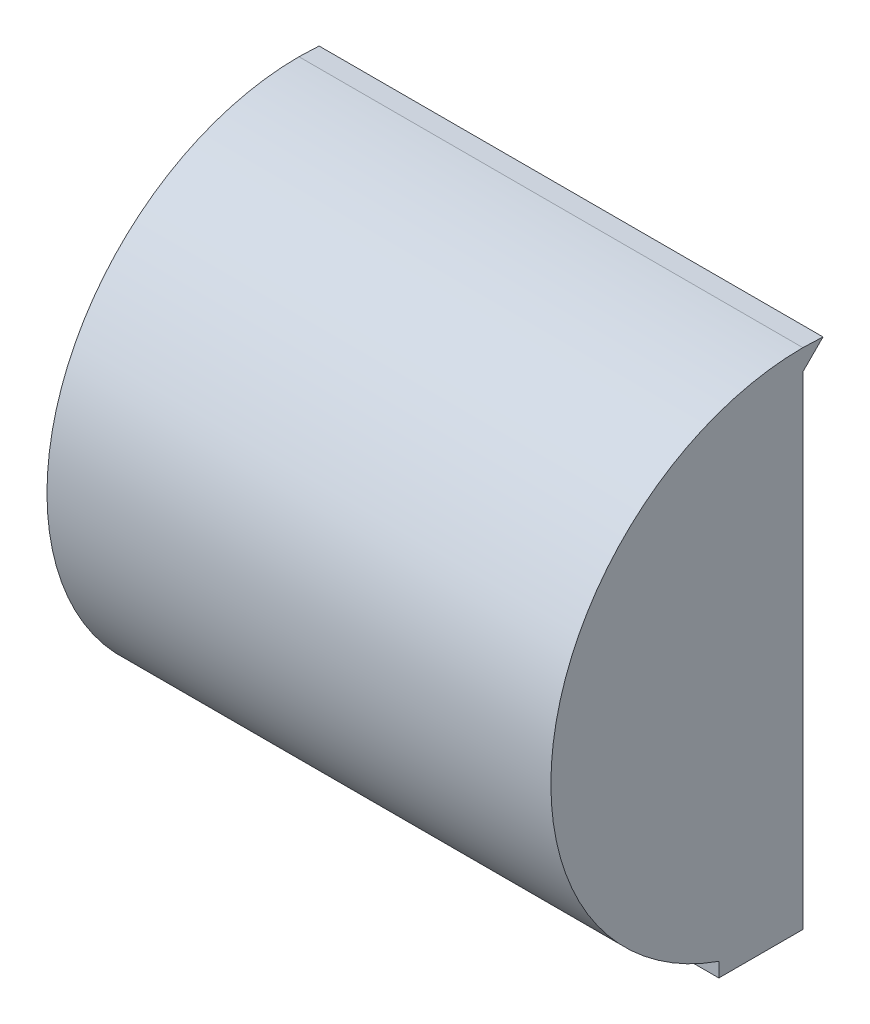
ISO-10303-21;
HEADER;
FILE_DESCRIPTION(('STEP AP214'),'2;1');
FILE_NAME('part.step','',(''),(''),'','','');
FILE_SCHEMA(('AUTOMOTIVE_DESIGN { 1 0 10303 214 1 1 1 1 }'));
ENDSEC;
DATA;
#1=APPLICATION_CONTEXT('core data for automotive mechanical design processes');
#2=APPLICATION_PROTOCOL_DEFINITION('international standard','automotive_design',2000,#1);
#3=PRODUCT_CONTEXT('',#1,'mechanical');
#4=PRODUCT('Part','Part','',(#3));
#5=PRODUCT_RELATED_PRODUCT_CATEGORY('part','',(#4));
#6=PRODUCT_DEFINITION_FORMATION('','',#4);
#7=PRODUCT_DEFINITION_CONTEXT('part definition',#1,'design');
#8=PRODUCT_DEFINITION('design','',#6,#7);
#9=PRODUCT_DEFINITION_SHAPE('','',#8);
#10=(LENGTH_UNIT() NAMED_UNIT(*) SI_UNIT(.MILLI.,.METRE.));
#11=(NAMED_UNIT(*) PLANE_ANGLE_UNIT() SI_UNIT($,.RADIAN.));
#12=(NAMED_UNIT(*) SI_UNIT($,.STERADIAN.) SOLID_ANGLE_UNIT());
#13=UNCERTAINTY_MEASURE_WITH_UNIT(LENGTH_MEASURE(1.E-05),#10,'distance_accuracy_value','');
#14=(GEOMETRIC_REPRESENTATION_CONTEXT(3) GLOBAL_UNCERTAINTY_ASSIGNED_CONTEXT((#13)) GLOBAL_UNIT_ASSIGNED_CONTEXT((#10,
#11,#12)) REPRESENTATION_CONTEXT('',''));
#15=CARTESIAN_POINT('',(0.,0.,0.));
#16=DIRECTION('',(0.,0.,1.));
#17=DIRECTION('',(1.,0.,0.));
#18=AXIS2_PLACEMENT_3D('',#15,#16,#17);
#19=CARTESIAN_POINT('',(38.1,38.1,0.));
#20=DIRECTION('',(-1.,0.,0.));
#21=DIRECTION('',(0.,0.,1.));
#22=AXIS2_PLACEMENT_3D('',#19,#20,#21);
#23=CYLINDRICAL_SURFACE('',#22,38.1);
#24=DIRECTION('',(-1.,0.,0.));
#25=VECTOR('',#24,1.);
#26=CARTESIAN_POINT('',(38.1,2.17897551572341,12.7));
#27=LINE('',#26,#25);
#28=CARTESIAN_POINT('',(38.1,2.1789755157234,12.7));
#29=VERTEX_POINT('',#28);
#30=CARTESIAN_POINT('',(-38.1,2.1789755157234,12.7));
#31=VERTEX_POINT('',#30);
#32=EDGE_CURVE('E142',#29,#31,#27,.T.);
#33=ORIENTED_EDGE('',*,*,#32,.F.);
#34=CARTESIAN_POINT('',(38.1,38.1,0.));
#35=DIRECTION('',(1.,0.,0.));
#36=DIRECTION('',(0.,0.,-1.));
#37=AXIS2_PLACEMENT_3D('',#34,#35,#36);
#38=CIRCLE('',#37,38.1);
#39=CARTESIAN_POINT('',(38.1,76.2,0.));
#40=VERTEX_POINT('',#39);
#41=EDGE_CURVE('E161',#40,#29,#38,.T.);
#42=ORIENTED_EDGE('',*,*,#41,.F.);
#43=DIRECTION('',(-1.,0.,0.));
#44=VECTOR('',#43,1.);
#45=CARTESIAN_POINT('',(38.1,76.2,0.));
#46=LINE('',#45,#44);
#47=CARTESIAN_POINT('',(-38.1,76.2,0.));
#48=VERTEX_POINT('',#47);
#49=EDGE_CURVE('E44',#40,#48,#46,.T.);
#50=ORIENTED_EDGE('',*,*,#49,.T.);
#51=CARTESIAN_POINT('',(-38.1,38.1,0.));
#52=DIRECTION('',(1.,0.,0.));
#53=DIRECTION('',(0.,0.,-1.));
#54=AXIS2_PLACEMENT_3D('',#51,#52,#53);
#55=CIRCLE('',#54,38.1);
#56=EDGE_CURVE('E154',#48,#31,#55,.T.);
#57=ORIENTED_EDGE('',*,*,#56,.T.);
#58=EDGE_LOOP('',(#33,#42,#50,#57));
#59=FACE_BOUND('',#58,.T.);
#60=ADVANCED_FACE('F36',(#59),#23,.T.);
#61=CARTESIAN_POINT('',(38.1,76.2,0.));
#62=DIRECTION('',(0.,0.,1.));
#63=DIRECTION('',(1.,0.,0.));
#64=AXIS2_PLACEMENT_3D('',#61,#62,#63);
#65=PLANE('',#64);
#66=DIRECTION('',(0.,1.,0.));
#67=VECTOR('',#66,1.);
#68=CARTESIAN_POINT('',(-38.1,76.2,0.));
#69=LINE('',#68,#67);
#70=CARTESIAN_POINT('',(-38.1,0.,0.));
#71=VERTEX_POINT('',#70);
#72=CARTESIAN_POINT('',(-38.1,73.025,0.));
#73=VERTEX_POINT('',#72);
#74=EDGE_CURVE('E58',#71,#73,#69,.T.);
#75=ORIENTED_EDGE('',*,*,#74,.T.);
#76=DIRECTION('',(1.,0.,0.));
#77=VECTOR('',#76,1.);
#78=CARTESIAN_POINT('',(-42.5043740207652,73.025,0.));
#79=LINE('',#78,#77);
#80=CARTESIAN_POINT('',(-34.925,73.025,0.));
#81=VERTEX_POINT('',#80);
#82=EDGE_CURVE('E114',#73,#81,#79,.T.);
#83=ORIENTED_EDGE('',*,*,#82,.T.);
#84=DIRECTION('',(0.,1.,0.));
#85=VECTOR('',#84,1.);
#86=CARTESIAN_POINT('',(-34.925,76.2,0.));
#87=LINE('',#86,#85);
#88=CARTESIAN_POINT('',(-34.925,3.17500000000001,0.));
#89=VERTEX_POINT('',#88);
#90=EDGE_CURVE('E148',#89,#81,#87,.T.);
#91=ORIENTED_EDGE('',*,*,#90,.F.);
#92=DIRECTION('',(-1.,0.,0.));
#93=VECTOR('',#92,1.);
#94=CARTESIAN_POINT('',(34.925,3.17500000000001,0.));
#95=LINE('',#94,#93);
#96=CARTESIAN_POINT('',(34.925,3.17500000000001,0.));
#97=VERTEX_POINT('',#96);
#98=EDGE_CURVE('E152',#97,#89,#95,.T.);
#99=ORIENTED_EDGE('',*,*,#98,.F.);
#100=DIRECTION('',(0.,1.,0.));
#101=VECTOR('',#100,1.);
#102=CARTESIAN_POINT('',(34.925,76.2,0.));
#103=LINE('',#102,#101);
#104=CARTESIAN_POINT('',(34.925,73.025,0.));
#105=VERTEX_POINT('',#104);
#106=EDGE_CURVE('E151',#97,#105,#103,.T.);
#107=ORIENTED_EDGE('',*,*,#106,.T.);
#108=CARTESIAN_POINT('',(38.1,73.025,0.));
#109=VERTEX_POINT('',#108);
#110=EDGE_CURVE('E52',#105,#109,#79,.T.);
#111=ORIENTED_EDGE('',*,*,#110,.T.);
#112=DIRECTION('',(0.,1.,0.));
#113=VECTOR('',#112,1.);
#114=CARTESIAN_POINT('',(38.1,0.,0.));
#115=LINE('',#114,#113);
#116=CARTESIAN_POINT('',(38.1,0.,0.));
#117=VERTEX_POINT('',#116);
#118=EDGE_CURVE('E125',#117,#109,#115,.T.);
#119=ORIENTED_EDGE('',*,*,#118,.F.);
#120=DIRECTION('',(-1.,0.,0.));
#121=VECTOR('',#120,1.);
#122=CARTESIAN_POINT('',(38.1,0.,0.));
#123=LINE('',#122,#121);
#124=EDGE_CURVE('E11',#117,#71,#123,.T.);
#125=ORIENTED_EDGE('',*,*,#124,.T.);
#126=EDGE_LOOP('',(#75,#83,#91,#99,#107,#111,#119,#125));
#127=FACE_BOUND('',#126,.T.);
#128=ADVANCED_FACE('F210',(#127),#65,.F.);
#129=CARTESIAN_POINT('',(38.1,38.1,0.));
#130=DIRECTION('',(1.,0.,0.));
#131=DIRECTION('',(0.,0.,-1.));
#132=AXIS2_PLACEMENT_3D('',#129,#130,#131);
#133=PLANE('',#132);
#134=ORIENTED_EDGE('',*,*,#118,.T.);
#135=DIRECTION('',(0.,0.707106781186553,-0.707106781186542));
#136=VECTOR('',#135,1.);
#137=CARTESIAN_POINT('',(38.1,76.0775211735206,-3.0525211735206));
#138=LINE('',#137,#136);
#139=CARTESIAN_POINT('',(38.1,76.0775211735206,-3.0525211735206));
#140=VERTEX_POINT('',#139);
#141=EDGE_CURVE('E109',#109,#140,#138,.T.);
#142=ORIENTED_EDGE('',*,*,#141,.T.);
#143=DIRECTION('',(0.,0.0400915662057655,0.999196009959592));
#144=VECTOR('',#143,1.);
#145=CARTESIAN_POINT('',(38.1,76.2,0.));
#146=LINE('',#145,#144);
#147=EDGE_CURVE('E118',#140,#40,#146,.T.);
#148=ORIENTED_EDGE('',*,*,#147,.T.);
#149=ORIENTED_EDGE('',*,*,#41,.T.);
#150=DIRECTION('',(0.,-1.,0.));
#151=VECTOR('',#150,1.);
#152=CARTESIAN_POINT('',(38.1,0.,12.7));
#153=LINE('',#152,#151);
#154=CARTESIAN_POINT('',(38.1,0.,12.7));
#155=VERTEX_POINT('',#154);
#156=EDGE_CURVE('E133',#29,#155,#153,.T.);
#157=ORIENTED_EDGE('',*,*,#156,.T.);
#158=DIRECTION('',(0.,0.,-1.));
#159=VECTOR('',#158,1.);
#160=CARTESIAN_POINT('',(38.1,0.,12.7));
#161=LINE('',#160,#159);
#162=EDGE_CURVE('E139',#155,#117,#161,.T.);
#163=ORIENTED_EDGE('',*,*,#162,.T.);
#164=EDGE_LOOP('',(#134,#142,#148,#149,#157,#163));
#165=FACE_BOUND('',#164,.T.);
#166=ADVANCED_FACE('F124',(#165),#133,.T.);
#167=CARTESIAN_POINT('',(-38.1,38.1,0.));
#168=DIRECTION('',(1.,0.,0.));
#169=DIRECTION('',(0.,0.,-1.));
#170=AXIS2_PLACEMENT_3D('',#167,#168,#169);
#171=PLANE('',#170);
#172=ORIENTED_EDGE('',*,*,#56,.F.);
#173=DIRECTION('',(0.,-0.0400915662057655,-0.999196009959592));
#174=VECTOR('',#173,1.);
#175=CARTESIAN_POINT('',(-38.1,76.2,0.));
#176=LINE('',#175,#174);
#177=CARTESIAN_POINT('',(-38.1,76.0775211735206,-3.0525211735206));
#178=VERTEX_POINT('',#177);
#179=EDGE_CURVE('E134',#48,#178,#176,.T.);
#180=ORIENTED_EDGE('',*,*,#179,.T.);
#181=DIRECTION('',(0.,-0.707106781186553,0.707106781186542));
#182=VECTOR('',#181,1.);
#183=CARTESIAN_POINT('',(-38.1,76.0775211735206,-3.0525211735206));
#184=LINE('',#183,#182);
#185=EDGE_CURVE('E111',#178,#73,#184,.T.);
#186=ORIENTED_EDGE('',*,*,#185,.T.);
#187=ORIENTED_EDGE('',*,*,#74,.F.);
#188=DIRECTION('',(0.,0.,-1.));
#189=VECTOR('',#188,1.);
#190=CARTESIAN_POINT('',(-38.1,0.,12.7));
#191=LINE('',#190,#189);
#192=CARTESIAN_POINT('',(-38.1,0.,12.7));
#193=VERTEX_POINT('',#192);
#194=EDGE_CURVE('E140',#193,#71,#191,.T.);
#195=ORIENTED_EDGE('',*,*,#194,.F.);
#196=DIRECTION('',(0.,1.,0.));
#197=VECTOR('',#196,1.);
#198=CARTESIAN_POINT('',(-38.1,0.,12.7));
#199=LINE('',#198,#197);
#200=EDGE_CURVE('E130',#193,#31,#199,.T.);
#201=ORIENTED_EDGE('',*,*,#200,.T.);
#202=EDGE_LOOP('',(#172,#180,#186,#187,#195,#201));
#203=FACE_BOUND('',#202,.T.);
#204=ADVANCED_FACE('F226',(#203),#171,.F.);
#205=CARTESIAN_POINT('',(38.1,38.1,0.));
#206=DIRECTION('',(-1.,0.,0.));
#207=DIRECTION('',(0.,0.,1.));
#208=AXIS2_PLACEMENT_3D('',#205,#206,#207);
#209=CYLINDRICAL_SURFACE('',#208,34.925);
#210=CARTESIAN_POINT('',(19.05,3.29736527215218,2.921));
#211=CARTESIAN_POINT('',(19.2419435148805,3.29736457951155,2.92100822635639));
#212=CARTESIAN_POINT('',(19.4340143083735,3.2987107306847,2.9371701448473));
#213=CARTESIAN_POINT('',(19.8128528578552,3.30419292414882,3.00140546162799));
#214=CARTESIAN_POINT('',(19.9996145287077,3.30833204312787,3.04951405092322));
#215=CARTESIAN_POINT('',(20.3623115529667,3.3196730123046,3.17624047783401));
#216=CARTESIAN_POINT('',(20.5382515627573,3.32687353452728,3.25484508559966));
#217=CARTESIAN_POINT('',(20.8743382027945,3.34472769715652,3.4402475008922));
#218=CARTESIAN_POINT('',(21.0344885484951,3.35538052266277,3.54703865401198));
#219=CARTESIAN_POINT('',(21.3345479523628,3.38057525502671,3.78570027963589));
#220=CARTESIAN_POINT('',(21.4744542367335,3.3951176940545,3.91757418320422));
#221=CARTESIAN_POINT('',(21.7301015455419,3.4284683502658,4.20250504610802));
#222=CARTESIAN_POINT('',(21.8458418393011,3.44727669639664,4.35556264571724));
#223=CARTESIAN_POINT('',(22.0502556589836,3.48942800934829,4.67872896632293));
#224=CARTESIAN_POINT('',(22.1388659625503,3.51278136375459,4.84887630635715));
#225=CARTESIAN_POINT('',(22.2863827921101,3.56397085759978,5.20095536084557));
#226=CARTESIAN_POINT('',(22.3452883524339,3.59180714273513,5.38288745819262));
#227=CARTESIAN_POINT('',(22.4324325610132,3.65190184546445,5.75499529825202));
#228=CARTESIAN_POINT('',(22.4603932372089,3.68419746100796,5.945230057033));
#229=CARTESIAN_POINT('',(22.4842566072378,3.75234347485465,6.32706384168286));
#230=CARTESIAN_POINT('',(22.4801563934269,3.78819419528384,6.51866298971565));
#231=CARTESIAN_POINT('',(22.4399599228012,3.86306349527274,6.90118939783763));
#232=CARTESIAN_POINT('',(22.4033325184463,3.90212485317722,7.09205245494625));
#233=CARTESIAN_POINT('',(22.2985475908971,3.98151604195826,7.46464973562233));
#234=CARTESIAN_POINT('',(22.2303863776877,4.02184602077107,7.64638288806916));
#235=CARTESIAN_POINT('',(22.0631259509903,4.10276298304281,7.99854117440237));
#236=CARTESIAN_POINT('',(21.9635680154462,4.14334441281518,8.16874997765203));
#237=CARTESIAN_POINT('',(21.7364853934103,4.22223129042445,8.48998287743717));
#238=CARTESIAN_POINT('',(21.6089597845096,4.26053666314116,8.64100634095666));
#239=CARTESIAN_POINT('',(21.3296244666985,4.33275885526112,8.91906225379602));
#240=CARTESIAN_POINT('',(21.1778807431087,4.36668715885091,9.04615790317447));
#241=CARTESIAN_POINT('',(20.8539311970648,4.42828927183319,9.27282944986045));
#242=CARTESIAN_POINT('',(20.6817288574404,4.45596414347493,9.37241002170211));
#243=CARTESIAN_POINT('',(20.3268270198199,4.50261384925137,9.53826606838298));
#244=CARTESIAN_POINT('',(20.1445562996869,4.52181053436125,9.60539580933128));
#245=CARTESIAN_POINT('',(19.7706374238165,4.55133518216681,9.70801751192221));
#246=CARTESIAN_POINT('',(19.5789915963566,4.56166533513677,9.74351728710803));
#247=CARTESIAN_POINT('',(19.1989684396047,4.57254686727753,9.78089327589701));
#248=CARTESIAN_POINT('',(19.0107111930407,4.57342759372503,9.78390194882592));
#249=CARTESIAN_POINT('',(18.6364219199386,4.5662083091393,9.75912922046636));
#250=CARTESIAN_POINT('',(18.4503896987602,4.55810908954703,9.73135053259944));
#251=CARTESIAN_POINT('',(18.0880453904976,4.53360959065754,9.6464996913602));
#252=CARTESIAN_POINT('',(17.9116448349354,4.51730787333718,9.58977524104897));
#253=CARTESIAN_POINT('',(17.5709481983597,4.47745636912292,9.44910042995448));
#254=CARTESIAN_POINT('',(17.4066532226497,4.45390592139539,9.36514758684553));
#255=CARTESIAN_POINT('',(17.090974844024,4.40033491367606,9.17052681188093));
#256=CARTESIAN_POINT('',(16.9399399200943,4.37018752067315,9.0593291890433));
#257=CARTESIAN_POINT('',(16.6584822808026,4.30536786584563,8.81444712274967));
#258=CARTESIAN_POINT('',(16.5280633152938,4.2706947829288,8.68075859751298));
#259=CARTESIAN_POINT('',(16.286673919117,4.19724096192346,8.38939067145561));
#260=CARTESIAN_POINT('',(16.1765595311467,4.15835802671878,8.23102743994114));
#261=CARTESIAN_POINT('',(15.9844491652004,4.07940190343136,7.89833785094796));
#262=CARTESIAN_POINT('',(15.9024571472415,4.03932854858371,7.72400924970067));
#263=CARTESIAN_POINT('',(15.7672067329548,3.95877559753054,7.359886718582));
#264=CARTESIAN_POINT('',(15.7146439558208,3.91830747769114,7.16983129605685));
#265=CARTESIAN_POINT('',(15.6427806558473,3.83946754124102,6.78310171611066));
#266=CARTESIAN_POINT('',(15.6234803006918,3.8010957351993,6.58642752532788));
#267=CARTESIAN_POINT('',(15.6189733507552,3.72778448245957,6.19245380423006));
#268=CARTESIAN_POINT('',(15.6336964945691,3.69283811733199,5.9951564013727));
#269=CARTESIAN_POINT('',(15.6970151394688,3.62718738513341,5.60534415765582));
#270=CARTESIAN_POINT('',(15.7456075248077,3.59648262817375,5.41282887855946));
#271=CARTESIAN_POINT('',(15.8744488977751,3.54030691888876,5.04161854123174));
#272=CARTESIAN_POINT('',(15.9541477716439,3.51475612881285,4.86274463378959));
#273=CARTESIAN_POINT('',(16.143129731796,3.46838669569111,4.52070796990885));
#274=CARTESIAN_POINT('',(16.2524092380117,3.44756748055553,4.35754331545748));
#275=CARTESIAN_POINT('',(16.495598651665,3.41078900973099,4.05429235443655));
#276=CARTESIAN_POINT('',(16.6291030321269,3.3947598026374,3.9138891426822));
#277=CARTESIAN_POINT('',(16.9181068803664,3.36678576660456,3.65734234851472));
#278=CARTESIAN_POINT('',(17.0736104816298,3.354841706678,3.54120333533984));
#279=CARTESIAN_POINT('',(17.4010465310768,3.33467144304908,3.33736612412304));
#280=CARTESIAN_POINT('',(17.5728661555813,3.32642168103457,3.24948874717901));
#281=CARTESIAN_POINT('',(17.9287749065715,3.31311416609089,3.10380384175223));
#282=CARTESIAN_POINT('',(18.1128501390841,3.30805286436104,3.04596289495179));
#283=CARTESIAN_POINT('',(18.4232951191462,3.30204895207868,2.97639803950294));
#284=CARTESIAN_POINT('',(18.5477028290095,3.30028817026648,2.95565179896856));
#285=CARTESIAN_POINT('',(18.7980554103513,3.29794655757581,2.9279500783784));
#286=CARTESIAN_POINT('',(18.9240002820031,3.29736572683034,2.92099459987702));
#287=CARTESIAN_POINT('',(19.05,3.29736527215218,2.921));
#288=B_SPLINE_CURVE_WITH_KNOTS('',3,(#210,#211,#212,#213,#214,#215,#216,#217,#218,#219,#220,
#221,#222,#223,#224,#225,#226,#227,#228,#229,#230,#231,#232,#233,#234,#235,#236,#237,#238,#239,
#240,#241,#242,#243,#244,#245,#246,#247,#248,#249,#250,#251,#252,#253,#254,#255,#256,#257,#258,
#259,#260,#261,#262,#263,#264,#265,#266,#267,#268,#269,#270,#271,#272,#273,#274,#275,#276,#277,
#278,#279,#280,#281,#282,#283,#284,#285,#286,#287),.UNSPECIFIED.,.T.,.F.,(4,2,2,2,2,2,2,2,2,2,2,
2,2,2,2,2,2,2,2,2,2,2,2,2,2,2,2,2,2,2,2,2,2,2,2,2,2,2,4),(0.,0.575372046317112,1.15137895012931,
1.72713624827419,2.30275774042553,2.8784580284221,3.45417572066693,4.03122500028528,
4.60829303794625,5.19050372473134,5.77276721357948,6.36471716708991,6.95673640677448,
7.5578407624259,8.15896494623287,8.75847840632107,9.35788995240824,9.94052241607433,
10.5230109122401,11.0851287366344,11.647197023124,12.2026672077948,12.7581880471514,
13.3255114316603,13.8929378886317,14.4805328684661,15.0682105558322,15.6692487379314,
16.2702899500025,16.8700910705905,17.4698370207148,18.0594249551925,18.6489415652446,
19.2293732590969,19.8099141568429,20.3866983405188,20.9628394158536,21.3405375498754,
21.7182357264686),.UNSPECIFIED.);
#289=CARTESIAN_POINT('',(19.05,3.29736527215218,2.921));
#290=VERTEX_POINT('',#289);
#291=EDGE_CURVE('E169',#290,#290,#288,.T.);
#292=ORIENTED_EDGE('',*,*,#291,.T.);
#293=EDGE_LOOP('',(#292));
#294=FACE_BOUND('',#293,.T.);
#295=CARTESIAN_POINT('',(-19.05,3.29736527215218,2.921));
#296=CARTESIAN_POINT('',(-18.8580564851195,3.29736457951155,2.92100822635639));
#297=CARTESIAN_POINT('',(-18.6659856916265,3.2987107306847,2.93717014484731));
#298=CARTESIAN_POINT('',(-18.2871471421448,3.30419292414882,3.00140546162799));
#299=CARTESIAN_POINT('',(-18.1003854712923,3.30833204312787,3.04951405092322));
#300=CARTESIAN_POINT('',(-17.7376884470333,3.3196730123046,3.17624047783401));
#301=CARTESIAN_POINT('',(-17.5617484372428,3.32687353452728,3.25484508559966));
#302=CARTESIAN_POINT('',(-17.2256617972055,3.34472769715652,3.4402475008922));
#303=CARTESIAN_POINT('',(-17.0655114515049,3.35538052266277,3.54703865401198));
#304=CARTESIAN_POINT('',(-16.7654520476372,3.38057525502671,3.78570027963589));
#305=CARTESIAN_POINT('',(-16.6255457632665,3.3951176940545,3.91757418320422));
#306=CARTESIAN_POINT('',(-16.3698984544581,3.4284683502658,4.20250504610802));
#307=CARTESIAN_POINT('',(-16.2541581606989,3.44727669639664,4.35556264571724));
#308=CARTESIAN_POINT('',(-16.0497443410164,3.48942800934829,4.67872896632294));
#309=CARTESIAN_POINT('',(-15.9611340374497,3.51278136375459,4.84887630635716));
#310=CARTESIAN_POINT('',(-15.8136172078899,3.56397085759979,5.20095536084557));
#311=CARTESIAN_POINT('',(-15.7547116475661,3.59180714273513,5.38288745819262));
#312=CARTESIAN_POINT('',(-15.6675674389868,3.65190184546445,5.75499529825202));
#313=CARTESIAN_POINT('',(-15.6396067627911,3.68419746100796,5.945230057033));
#314=CARTESIAN_POINT('',(-15.6157433927622,3.75234347485465,6.32706384168286));
#315=CARTESIAN_POINT('',(-15.6198436065731,3.78819419528384,6.51866298971564));
#316=CARTESIAN_POINT('',(-15.6600400771988,3.86306349527274,6.90118939783763));
#317=CARTESIAN_POINT('',(-15.6966674815537,3.90212485317722,7.09205245494625));
#318=CARTESIAN_POINT('',(-15.8014524091029,3.98151604195826,7.46464973562232));
#319=CARTESIAN_POINT('',(-15.8696136223123,4.02184602077107,7.64638288806915));
#320=CARTESIAN_POINT('',(-16.0368740490097,4.10276298304281,7.99854117440237));
#321=CARTESIAN_POINT('',(-16.1364319845538,4.14334441281517,8.16874997765203));
#322=CARTESIAN_POINT('',(-16.3635146065897,4.22223129042444,8.48998287743717));
#323=CARTESIAN_POINT('',(-16.4910402154904,4.26053666314116,8.64100634095666));
#324=CARTESIAN_POINT('',(-16.7703755333015,4.33275885526112,8.91906225379601));
#325=CARTESIAN_POINT('',(-16.9221192568913,4.36668715885091,9.04615790317446));
#326=CARTESIAN_POINT('',(-17.2460688029352,4.42828927183319,9.27282944986045));
#327=CARTESIAN_POINT('',(-17.4182711425596,4.45596414347493,9.37241002170211));
#328=CARTESIAN_POINT('',(-17.7731729801801,4.50261384925137,9.53826606838297));
#329=CARTESIAN_POINT('',(-17.9554437003131,4.52181053436124,9.60539580933128));
#330=CARTESIAN_POINT('',(-18.3293625761835,4.55133518216681,9.70801751192221));
#331=CARTESIAN_POINT('',(-18.5210084036434,4.56166533513677,9.74351728710803));
#332=CARTESIAN_POINT('',(-18.9010315603953,4.57254686727753,9.78089327589701));
#333=CARTESIAN_POINT('',(-19.0892888069593,4.57342759372503,9.78390194882592));
#334=CARTESIAN_POINT('',(-19.4635780800613,4.5662083091393,9.75912922046635));
#335=CARTESIAN_POINT('',(-19.6496103012398,4.55810908954703,9.73135053259944));
#336=CARTESIAN_POINT('',(-20.0119546095024,4.53360959065754,9.6464996913602));
#337=CARTESIAN_POINT('',(-20.1883551650646,4.51730787333718,9.58977524104897));
#338=CARTESIAN_POINT('',(-20.5290518016403,4.47745636912292,9.44910042995448));
#339=CARTESIAN_POINT('',(-20.6933467773503,4.45390592139539,9.36514758684553));
#340=CARTESIAN_POINT('',(-21.009025155976,4.40033491367606,9.17052681188093));
#341=CARTESIAN_POINT('',(-21.1600600799057,4.37018752067315,9.0593291890433));
#342=CARTESIAN_POINT('',(-21.4415177191974,4.30536786584563,8.81444712274967));
#343=CARTESIAN_POINT('',(-21.5719366847062,4.2706947829288,8.68075859751297));
#344=CARTESIAN_POINT('',(-21.813326080883,4.19724096192347,8.3893906714556));
#345=CARTESIAN_POINT('',(-21.9234404688533,4.15835802671878,8.23102743994114));
#346=CARTESIAN_POINT('',(-22.1155508347996,4.07940190343135,7.89833785094796));
#347=CARTESIAN_POINT('',(-22.1975428527585,4.03932854858371,7.72400924970067));
#348=CARTESIAN_POINT('',(-22.3327932670452,3.95877559753054,7.359886718582));
#349=CARTESIAN_POINT('',(-22.3853560441792,3.91830747769114,7.16983129605685));
#350=CARTESIAN_POINT('',(-22.4572193441527,3.83946754124103,6.78310171611066));
#351=CARTESIAN_POINT('',(-22.4765196993082,3.80109573519929,6.58642752532788));
#352=CARTESIAN_POINT('',(-22.4810266492448,3.72778448245957,6.19245380423006));
#353=CARTESIAN_POINT('',(-22.4663035054309,3.692838117332,5.9951564013727));
#354=CARTESIAN_POINT('',(-22.4029848605312,3.62718738513342,5.60534415765582));
#355=CARTESIAN_POINT('',(-22.3543924751923,3.59648262817375,5.41282887855947));
#356=CARTESIAN_POINT('',(-22.2255511022249,3.54030691888876,5.04161854123174));
#357=CARTESIAN_POINT('',(-22.1458522283561,3.51475612881285,4.86274463378959));
#358=CARTESIAN_POINT('',(-21.956870268204,3.46838669569111,4.52070796990885));
#359=CARTESIAN_POINT('',(-21.8475907619883,3.44756748055553,4.35754331545748));
#360=CARTESIAN_POINT('',(-21.604401348335,3.410789009731,4.05429235443656));
#361=CARTESIAN_POINT('',(-21.4708969678731,3.39475980263741,3.9138891426822));
#362=CARTESIAN_POINT('',(-21.1818931196336,3.36678576660457,3.65734234851472));
#363=CARTESIAN_POINT('',(-21.0263895183702,3.354841706678,3.54120333533985));
#364=CARTESIAN_POINT('',(-20.6989534689232,3.33467144304908,3.33736612412305));
#365=CARTESIAN_POINT('',(-20.5271338444187,3.32642168103457,3.24948874717901));
#366=CARTESIAN_POINT('',(-20.1712250934285,3.31311416609089,3.10380384175223));
#367=CARTESIAN_POINT('',(-19.9871498609159,3.30805286436105,3.0459628949518));
#368=CARTESIAN_POINT('',(-19.6767048808538,3.30204895207869,2.97639803950294));
#369=CARTESIAN_POINT('',(-19.5522971709905,3.30028817026648,2.95565179896856));
#370=CARTESIAN_POINT('',(-19.3019445896487,3.29794655757581,2.92795007837841));
#371=CARTESIAN_POINT('',(-19.1759997179969,3.29736572683034,2.92099459987702));
#372=CARTESIAN_POINT('',(-19.05,3.29736527215218,2.921));
#373=B_SPLINE_CURVE_WITH_KNOTS('',3,(#295,#296,#297,#298,#299,#300,#301,#302,#303,#304,#305,
#306,#307,#308,#309,#310,#311,#312,#313,#314,#315,#316,#317,#318,#319,#320,#321,#322,#323,#324,
#325,#326,#327,#328,#329,#330,#331,#332,#333,#334,#335,#336,#337,#338,#339,#340,#341,#342,#343,
#344,#345,#346,#347,#348,#349,#350,#351,#352,#353,#354,#355,#356,#357,#358,#359,#360,#361,#362,
#363,#364,#365,#366,#367,#368,#369,#370,#371,#372),.UNSPECIFIED.,.T.,.F.,(4,2,2,2,2,2,2,2,2,2,2,
2,2,2,2,2,2,2,2,2,2,2,2,2,2,2,2,2,2,2,2,2,2,2,2,2,2,2,4),(0.,0.575372046317108,1.1513789501293,
1.72713624827418,2.30275774042552,2.87845802842209,3.45417572066693,4.03122500028528,
4.60829303794624,5.19050372473133,5.77276721357947,6.3647171670899,6.95673640677447,
7.55784076242589,8.15896494623285,8.75847840632105,9.35788995240823,9.94052241607432,
10.5230109122401,11.0851287366344,11.647197023124,12.2026672077948,12.7581880471513,
13.3255114316603,13.8929378886317,14.4805328684661,15.0682105558322,15.6692487379314,
16.2702899500025,16.8700910705905,17.4698370207147,18.0594249551925,18.6489415652445,
19.2293732590968,19.8099141568429,20.3866983405188,20.9628394158536,21.3405375498754,
21.7182357264686),.UNSPECIFIED.);
#374=CARTESIAN_POINT('',(-19.05,3.29736527215218,2.921));
#375=VERTEX_POINT('',#374);
#376=EDGE_CURVE('E180',#375,#375,#373,.T.);
#377=ORIENTED_EDGE('',*,*,#376,.T.);
#378=EDGE_LOOP('',(#377));
#379=FACE_BOUND('',#378,.T.);
#380=CARTESIAN_POINT('',(-34.925,38.1,0.));
#381=DIRECTION('',(1.,0.,0.));
#382=DIRECTION('',(0.,0.,-1.));
#383=AXIS2_PLACEMENT_3D('',#380,#381,#382);
#384=CIRCLE('',#383,34.925);
#385=EDGE_CURVE('E145',#81,#89,#384,.T.);
#386=ORIENTED_EDGE('',*,*,#385,.F.);
#387=DIRECTION('',(-1.,0.,0.));
#388=VECTOR('',#387,1.);
#389=CARTESIAN_POINT('',(34.925,73.025,0.));
#390=LINE('',#389,#388);
#391=EDGE_CURVE('E155',#105,#81,#390,.T.);
#392=ORIENTED_EDGE('',*,*,#391,.F.);
#393=CARTESIAN_POINT('',(34.925,38.1,0.));
#394=DIRECTION('',(1.,0.,0.));
#395=DIRECTION('',(0.,0.,-1.));
#396=AXIS2_PLACEMENT_3D('',#393,#394,#395);
#397=CIRCLE('',#396,34.925);
#398=EDGE_CURVE('E149',#105,#97,#397,.T.);
#399=ORIENTED_EDGE('',*,*,#398,.T.);
#400=ORIENTED_EDGE('',*,*,#98,.T.);
#401=EDGE_LOOP('',(#386,#392,#399,#400));
#402=FACE_BOUND('',#401,.T.);
#403=ADVANCED_FACE('F233',(#294,#379,#402),#209,.F.);
#404=CARTESIAN_POINT('',(34.925,38.1,0.));
#405=DIRECTION('',(1.,0.,0.));
#406=DIRECTION('',(0.,0.,-1.));
#407=AXIS2_PLACEMENT_3D('',#404,#405,#406);
#408=PLANE('',#407);
#409=ORIENTED_EDGE('',*,*,#398,.F.);
#410=ORIENTED_EDGE('',*,*,#106,.F.);
#411=EDGE_LOOP('',(#409,#410));
#412=FACE_BOUND('',#411,.T.);
#413=ADVANCED_FACE('F237',(#412),#408,.F.);
#414=CARTESIAN_POINT('',(-34.925,38.1,0.));
#415=DIRECTION('',(1.,0.,0.));
#416=DIRECTION('',(0.,0.,-1.));
#417=AXIS2_PLACEMENT_3D('',#414,#415,#416);
#418=PLANE('',#417);
#419=ORIENTED_EDGE('',*,*,#385,.T.);
#420=ORIENTED_EDGE('',*,*,#90,.T.);
#421=EDGE_LOOP('',(#419,#420));
#422=FACE_BOUND('',#421,.T.);
#423=ADVANCED_FACE('F231',(#422),#418,.T.);
#424=CARTESIAN_POINT('',(0.,0.,12.7));
#425=DIRECTION('',(0.,0.,-1.));
#426=DIRECTION('',(-1.,0.,0.));
#427=AXIS2_PLACEMENT_3D('',#424,#425,#426);
#428=PLANE('',#427);
#429=ORIENTED_EDGE('',*,*,#156,.F.);
#430=ORIENTED_EDGE('',*,*,#32,.T.);
#431=ORIENTED_EDGE('',*,*,#200,.F.);
#432=DIRECTION('',(-1.,0.,0.));
#433=VECTOR('',#432,1.);
#434=CARTESIAN_POINT('',(-38.1,0.,12.7));
#435=LINE('',#434,#433);
#436=EDGE_CURVE('E136',#155,#193,#435,.T.);
#437=ORIENTED_EDGE('',*,*,#436,.F.);
#438=EDGE_LOOP('',(#429,#430,#431,#437));
#439=FACE_BOUND('',#438,.T.);
#440=ADVANCED_FACE('F224',(#439),#428,.F.);
#441=CARTESIAN_POINT('',(-38.1,0.,12.7));
#442=DIRECTION('',(0.,-1.,0.));
#443=DIRECTION('',(0.,0.,-1.));
#444=AXIS2_PLACEMENT_3D('',#441,#442,#443);
#445=PLANE('',#444);
#446=CARTESIAN_POINT('',(19.05,0.,6.35));
#447=DIRECTION('',(0.,-1.,0.));
#448=DIRECTION('',(0.,0.,-1.));
#449=AXIS2_PLACEMENT_3D('',#446,#447,#448);
#450=CIRCLE('',#449,2.0828);
#451=CARTESIAN_POINT('',(19.05,0.,4.2672));
#452=VERTEX_POINT('',#451);
#453=EDGE_CURVE('E122',#452,#452,#450,.T.);
#454=ORIENTED_EDGE('',*,*,#453,.F.);
#455=EDGE_LOOP('',(#454));
#456=FACE_BOUND('',#455,.T.);
#457=CARTESIAN_POINT('',(-19.05,0.,6.35));
#458=DIRECTION('',(0.,-1.,0.));
#459=DIRECTION('',(0.,0.,1.));
#460=AXIS2_PLACEMENT_3D('',#457,#458,#459);
#461=CIRCLE('',#460,2.0828);
#462=CARTESIAN_POINT('',(-19.05,0.,8.4328));
#463=VERTEX_POINT('',#462);
#464=EDGE_CURVE('E173',#463,#463,#461,.T.);
#465=ORIENTED_EDGE('',*,*,#464,.F.);
#466=EDGE_LOOP('',(#465));
#467=FACE_BOUND('',#466,.T.);
#468=ORIENTED_EDGE('',*,*,#124,.F.);
#469=ORIENTED_EDGE('',*,*,#162,.F.);
#470=ORIENTED_EDGE('',*,*,#436,.T.);
#471=ORIENTED_EDGE('',*,*,#194,.T.);
#472=EDGE_LOOP('',(#468,#469,#470,#471));
#473=FACE_BOUND('',#472,.T.);
#474=ADVANCED_FACE('F223',(#456,#467,#473),#445,.T.);
#475=CARTESIAN_POINT('',(-42.5043740207652,76.2,0.));
#476=DIRECTION('',(0.,0.999196009959592,-0.0400915662057655));
#477=DIRECTION('',(0.,0.0400915662057655,0.999196009959592));
#478=AXIS2_PLACEMENT_3D('',#475,#476,#477);
#479=PLANE('',#478);
#480=ORIENTED_EDGE('',*,*,#179,.F.);
#481=ORIENTED_EDGE('',*,*,#49,.F.);
#482=ORIENTED_EDGE('',*,*,#147,.F.);
#483=DIRECTION('',(1.,0.,0.));
#484=VECTOR('',#483,1.);
#485=CARTESIAN_POINT('',(-42.5043740207652,76.0775211735206,-3.0525211735206));
#486=LINE('',#485,#484);
#487=EDGE_CURVE('E105',#178,#140,#486,.T.);
#488=ORIENTED_EDGE('',*,*,#487,.F.);
#489=EDGE_LOOP('',(#480,#481,#482,#488));
#490=FACE_BOUND('',#489,.T.);
#491=ADVANCED_FACE('F119',(#490),#479,.T.);
#492=CARTESIAN_POINT('',(-42.5043740207652,76.0775211735206,-3.0525211735206));
#493=DIRECTION('',(0.,-0.707106781186542,-0.707106781186553));
#494=DIRECTION('',(0.,0.707106781186553,-0.707106781186542));
#495=AXIS2_PLACEMENT_3D('',#492,#493,#494);
#496=PLANE('',#495);
#497=ORIENTED_EDGE('',*,*,#185,.F.);
#498=ORIENTED_EDGE('',*,*,#487,.T.);
#499=ORIENTED_EDGE('',*,*,#141,.F.);
#500=ORIENTED_EDGE('',*,*,#110,.F.);
#501=ORIENTED_EDGE('',*,*,#391,.T.);
#502=ORIENTED_EDGE('',*,*,#82,.F.);
#503=EDGE_LOOP('',(#497,#498,#499,#500,#501,#502));
#504=FACE_BOUND('',#503,.T.);
#505=ADVANCED_FACE('F107',(#504),#496,.T.);
#506=CARTESIAN_POINT('',(-19.05,76.201,6.35));
#507=DIRECTION('',(0.,-1.,0.));
#508=DIRECTION('',(0.,0.,-1.));
#509=AXIS2_PLACEMENT_3D('',#506,#507,#508);
#510=CYLINDRICAL_SURFACE('',#509,2.0828);
#511=CARTESIAN_POINT('',(-19.05,3.175,6.35));
#512=DIRECTION('',(0.,-1.,0.));
#513=DIRECTION('',(0.,0.,-1.));
#514=AXIS2_PLACEMENT_3D('',#511,#512,#513);
#515=CIRCLE('',#514,2.0828);
#516=CARTESIAN_POINT('',(-19.05,3.175,4.2672));
#517=VERTEX_POINT('',#516);
#518=EDGE_CURVE('E39',#517,#517,#515,.F.);
#519=ORIENTED_EDGE('',*,*,#518,.T.);
#520=EDGE_LOOP('',(#519));
#521=FACE_BOUND('',#520,.T.);
#522=ORIENTED_EDGE('',*,*,#464,.T.);
#523=EDGE_LOOP('',(#522));
#524=FACE_BOUND('',#523,.T.);
#525=ADVANCED_FACE('F205',(#521,#524),#510,.F.);
#526=CARTESIAN_POINT('',(19.05,76.201,6.35));
#527=DIRECTION('',(0.,-1.,0.));
#528=DIRECTION('',(0.,0.,-1.));
#529=AXIS2_PLACEMENT_3D('',#526,#527,#528);
#530=CYLINDRICAL_SURFACE('',#529,2.0828);
#531=CARTESIAN_POINT('',(19.05,3.175,6.35));
#532=DIRECTION('',(0.,-1.,0.));
#533=DIRECTION('',(0.,0.,-1.));
#534=AXIS2_PLACEMENT_3D('',#531,#532,#533);
#535=CIRCLE('',#534,2.0828);
#536=CARTESIAN_POINT('',(19.05,3.175,4.2672));
#537=VERTEX_POINT('',#536);
#538=EDGE_CURVE('E167',#537,#537,#535,.F.);
#539=ORIENTED_EDGE('',*,*,#538,.T.);
#540=EDGE_LOOP('',(#539));
#541=FACE_BOUND('',#540,.T.);
#542=ORIENTED_EDGE('',*,*,#453,.T.);
#543=EDGE_LOOP('',(#542));
#544=FACE_BOUND('',#543,.T.);
#545=ADVANCED_FACE('F197',(#541,#544),#530,.F.);
#546=CARTESIAN_POINT('',(19.05,3.175,6.35));
#547=DIRECTION('',(0.,-1.,0.));
#548=DIRECTION('',(0.,0.,-1.));
#549=AXIS2_PLACEMENT_3D('',#546,#547,#548);
#550=PLANE('',#549);
#551=CARTESIAN_POINT('',(19.05,3.175,6.35));
#552=DIRECTION('',(0.,-1.,0.));
#553=DIRECTION('',(0.,0.,-1.));
#554=AXIS2_PLACEMENT_3D('',#551,#552,#553);
#555=CIRCLE('',#554,3.429);
#556=CARTESIAN_POINT('',(19.05,3.175,2.921));
#557=VERTEX_POINT('',#556);
#558=EDGE_CURVE('E175',#557,#557,#555,.T.);
#559=ORIENTED_EDGE('',*,*,#558,.F.);
#560=EDGE_LOOP('',(#559));
#561=FACE_BOUND('',#560,.T.);
#562=ORIENTED_EDGE('',*,*,#538,.F.);
#563=EDGE_LOOP('',(#562));
#564=FACE_BOUND('',#563,.T.);
#565=ADVANCED_FACE('F195',(#561,#564),#550,.F.);
#566=CARTESIAN_POINT('',(19.05,76.201,6.35));
#567=DIRECTION('',(0.,-1.,0.));
#568=DIRECTION('',(0.,0.,-1.));
#569=AXIS2_PLACEMENT_3D('',#566,#567,#568);
#570=CYLINDRICAL_SURFACE('',#569,3.429);
#571=ORIENTED_EDGE('',*,*,#558,.T.);
#572=EDGE_LOOP('',(#571));
#573=FACE_BOUND('',#572,.T.);
#574=ORIENTED_EDGE('',*,*,#291,.F.);
#575=EDGE_LOOP('',(#574));
#576=FACE_BOUND('',#575,.T.);
#577=ADVANCED_FACE('F190',(#573,#576),#570,.F.);
#578=CARTESIAN_POINT('',(-19.05,3.175,6.35));
#579=DIRECTION('',(0.,-1.,0.));
#580=DIRECTION('',(0.,0.,-1.));
#581=AXIS2_PLACEMENT_3D('',#578,#579,#580);
#582=PLANE('',#581);
#583=CARTESIAN_POINT('',(-19.05,3.175,6.35));
#584=DIRECTION('',(0.,-1.,0.));
#585=DIRECTION('',(0.,0.,-1.));
#586=AXIS2_PLACEMENT_3D('',#583,#584,#585);
#587=CIRCLE('',#586,3.429);
#588=CARTESIAN_POINT('',(-19.05,3.175,2.921));
#589=VERTEX_POINT('',#588);
#590=EDGE_CURVE('E188',#589,#589,#587,.T.);
#591=ORIENTED_EDGE('',*,*,#590,.F.);
#592=EDGE_LOOP('',(#591));
#593=FACE_BOUND('',#592,.T.);
#594=ORIENTED_EDGE('',*,*,#518,.F.);
#595=EDGE_LOOP('',(#594));
#596=FACE_BOUND('',#595,.T.);
#597=ADVANCED_FACE('F203',(#593,#596),#582,.F.);
#598=CARTESIAN_POINT('',(-19.05,76.201,6.35));
#599=DIRECTION('',(0.,-1.,0.));
#600=DIRECTION('',(0.,0.,-1.));
#601=AXIS2_PLACEMENT_3D('',#598,#599,#600);
#602=CYLINDRICAL_SURFACE('',#601,3.429);
#603=ORIENTED_EDGE('',*,*,#590,.T.);
#604=EDGE_LOOP('',(#603));
#605=FACE_BOUND('',#604,.T.);
#606=ORIENTED_EDGE('',*,*,#376,.F.);
#607=EDGE_LOOP('',(#606));
#608=FACE_BOUND('',#607,.T.);
#609=ADVANCED_FACE('F302',(#605,#608),#602,.F.);
#610=CLOSED_SHELL('',(#60,#128,#166,#204,#403,#413,#423,#440,#474,#491,#505,#525,#545,#565,#577,
#597,#609));
#611=MANIFOLD_SOLID_BREP('B2',#610);
#612=ADVANCED_BREP_SHAPE_REPRESENTATION('',(#18,#611),#14);
#613=SHAPE_DEFINITION_REPRESENTATION(#9,#612);
ENDSEC;
END-ISO-10303-21;
